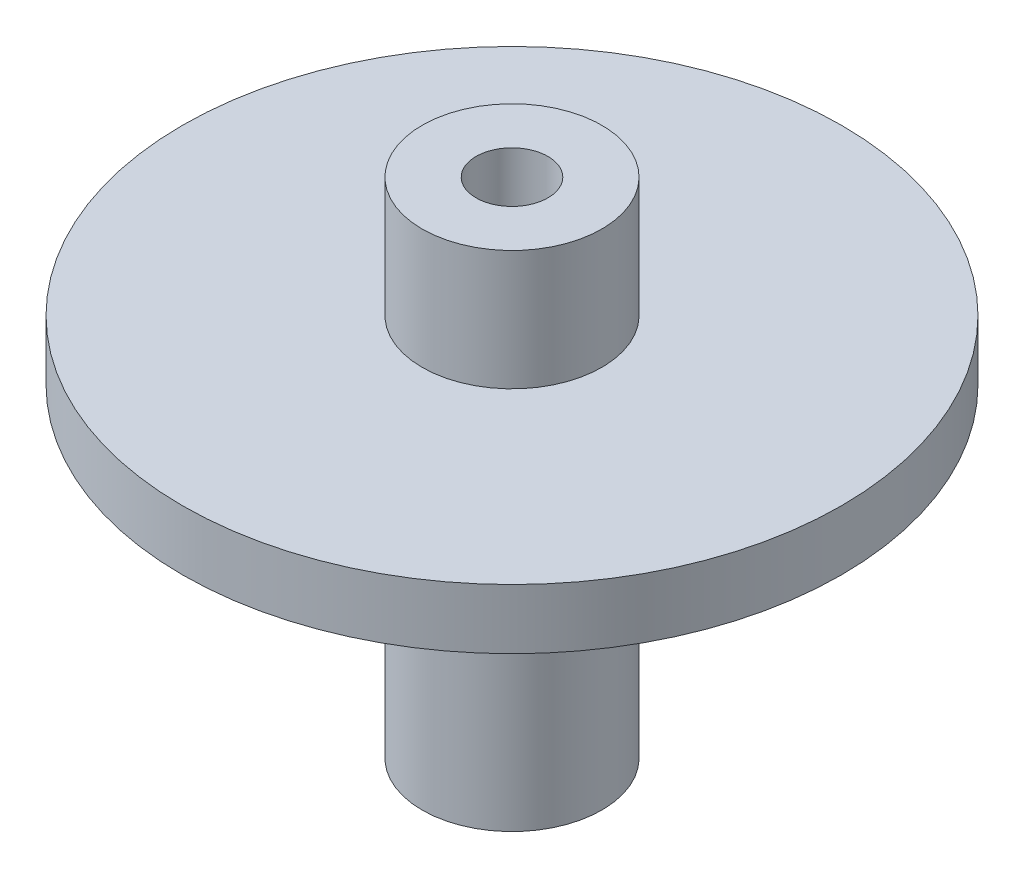
ISO-10303-21;
HEADER;
FILE_DESCRIPTION(('STEP AP214'),'2;1');
FILE_NAME('part.step','',(''),(''),'','','');
FILE_SCHEMA(('AUTOMOTIVE_DESIGN { 1 0 10303 214 1 1 1 1 }'));
ENDSEC;
DATA;
#1=APPLICATION_CONTEXT('core data for automotive mechanical design processes');
#2=APPLICATION_PROTOCOL_DEFINITION('international standard','automotive_design',2000,#1);
#3=PRODUCT_CONTEXT('',#1,'mechanical');
#4=PRODUCT('Part','Part','',(#3));
#5=PRODUCT_RELATED_PRODUCT_CATEGORY('part','',(#4));
#6=PRODUCT_DEFINITION_FORMATION('','',#4);
#7=PRODUCT_DEFINITION_CONTEXT('part definition',#1,'design');
#8=PRODUCT_DEFINITION('design','',#6,#7);
#9=PRODUCT_DEFINITION_SHAPE('','',#8);
#10=(LENGTH_UNIT() NAMED_UNIT(*) SI_UNIT(.MILLI.,.METRE.));
#11=(NAMED_UNIT(*) PLANE_ANGLE_UNIT() SI_UNIT($,.RADIAN.));
#12=(NAMED_UNIT(*) SI_UNIT($,.STERADIAN.) SOLID_ANGLE_UNIT());
#13=UNCERTAINTY_MEASURE_WITH_UNIT(LENGTH_MEASURE(1.E-05),#10,'distance_accuracy_value','');
#14=(GEOMETRIC_REPRESENTATION_CONTEXT(3) GLOBAL_UNCERTAINTY_ASSIGNED_CONTEXT((#13)) GLOBAL_UNIT_ASSIGNED_CONTEXT((#10,
#11,#12)) REPRESENTATION_CONTEXT('',''));
#15=CARTESIAN_POINT('',(0.,0.,0.));
#16=DIRECTION('',(0.,0.,1.));
#17=DIRECTION('',(1.,0.,0.));
#18=AXIS2_PLACEMENT_3D('',#15,#16,#17);
#19=CARTESIAN_POINT('',(0.,0.,3.));
#20=DIRECTION('',(0.,1.,0.));
#21=DIRECTION('',(0.,0.,1.));
#22=AXIS2_PLACEMENT_3D('',#19,#20,#21);
#23=PLANE('',#22);
#24=CARTESIAN_POINT('',(0.,0.,0.));
#25=DIRECTION('',(0.,1.,0.));
#26=DIRECTION('',(0.,0.,1.));
#27=AXIS2_PLACEMENT_3D('',#24,#25,#26);
#28=CIRCLE('',#27,27.5);
#29=CARTESIAN_POINT('',(0.,0.,27.5));
#30=VERTEX_POINT('',#29);
#31=EDGE_CURVE('E52',#30,#30,#28,.T.);
#32=ORIENTED_EDGE('',*,*,#31,.T.);
#33=EDGE_LOOP('',(#32));
#34=FACE_BOUND('',#33,.T.);
#35=CARTESIAN_POINT('',(0.,0.,0.));
#36=DIRECTION('',(0.,1.,0.));
#37=DIRECTION('',(0.,0.,1.));
#38=AXIS2_PLACEMENT_3D('',#35,#36,#37);
#39=CIRCLE('',#38,7.5);
#40=CARTESIAN_POINT('',(0.,0.,7.5));
#41=VERTEX_POINT('',#40);
#42=EDGE_CURVE('E56',#41,#41,#39,.T.);
#43=ORIENTED_EDGE('',*,*,#42,.F.);
#44=EDGE_LOOP('',(#43));
#45=FACE_BOUND('',#44,.T.);
#46=ADVANCED_FACE('F32',(#34,#45),#23,.T.);
#47=CARTESIAN_POINT('',(0.,21.6854158296505,0.));
#48=DIRECTION('',(0.,1.,0.));
#49=DIRECTION('',(0.,0.,1.));
#50=AXIS2_PLACEMENT_3D('',#47,#48,#49);
#51=CYLINDRICAL_SURFACE('',#50,27.5);
#52=CARTESIAN_POINT('',(0.,-5.,0.));
#53=DIRECTION('',(0.,1.,0.));
#54=DIRECTION('',(0.,0.,1.));
#55=AXIS2_PLACEMENT_3D('',#52,#53,#54);
#56=CIRCLE('',#55,27.5);
#57=CARTESIAN_POINT('',(0.,-5.,27.5));
#58=VERTEX_POINT('',#57);
#59=EDGE_CURVE('E10',#58,#58,#56,.T.);
#60=ORIENTED_EDGE('',*,*,#59,.T.);
#61=EDGE_LOOP('',(#60));
#62=FACE_BOUND('',#61,.T.);
#63=ORIENTED_EDGE('',*,*,#31,.F.);
#64=EDGE_LOOP('',(#63));
#65=FACE_BOUND('',#64,.T.);
#66=ADVANCED_FACE('F34',(#62,#65),#51,.T.);
#67=CARTESIAN_POINT('',(0.,-5.,27.5));
#68=DIRECTION('',(0.,-1.,0.));
#69=DIRECTION('',(0.,0.,-1.));
#70=AXIS2_PLACEMENT_3D('',#67,#68,#69);
#71=PLANE('',#70);
#72=CARTESIAN_POINT('',(0.,-5.,0.));
#73=DIRECTION('',(0.,1.,0.));
#74=DIRECTION('',(0.,0.,1.));
#75=AXIS2_PLACEMENT_3D('',#72,#73,#74);
#76=CIRCLE('',#75,7.5);
#77=CARTESIAN_POINT('',(0.,-5.,7.5));
#78=VERTEX_POINT('',#77);
#79=EDGE_CURVE('E39',#78,#78,#76,.T.);
#80=ORIENTED_EDGE('',*,*,#79,.T.);
#81=EDGE_LOOP('',(#80));
#82=FACE_BOUND('',#81,.T.);
#83=ORIENTED_EDGE('',*,*,#59,.F.);
#84=EDGE_LOOP('',(#83));
#85=FACE_BOUND('',#84,.T.);
#86=ADVANCED_FACE('F87',(#82,#85),#71,.T.);
#87=CARTESIAN_POINT('',(0.,21.6854158296505,0.));
#88=DIRECTION('',(0.,1.,0.));
#89=DIRECTION('',(0.,0.,1.));
#90=AXIS2_PLACEMENT_3D('',#87,#88,#89);
#91=CYLINDRICAL_SURFACE('',#90,7.5);
#92=CARTESIAN_POINT('',(0.,-32.,0.));
#93=DIRECTION('',(0.,1.,0.));
#94=DIRECTION('',(0.,0.,1.));
#95=AXIS2_PLACEMENT_3D('',#92,#93,#94);
#96=CIRCLE('',#95,7.49999999999999);
#97=CARTESIAN_POINT('',(0.,-32.,7.49999999999999));
#98=VERTEX_POINT('',#97);
#99=EDGE_CURVE('E43',#98,#98,#96,.T.);
#100=ORIENTED_EDGE('',*,*,#99,.T.);
#101=EDGE_LOOP('',(#100));
#102=FACE_BOUND('',#101,.T.);
#103=ORIENTED_EDGE('',*,*,#79,.F.);
#104=EDGE_LOOP('',(#103));
#105=FACE_BOUND('',#104,.T.);
#106=ADVANCED_FACE('F92',(#102,#105),#91,.T.);
#107=CARTESIAN_POINT('',(0.,-32.,7.49999999999999));
#108=DIRECTION('',(0.,-1.,0.));
#109=DIRECTION('',(0.,0.,-1.));
#110=AXIS2_PLACEMENT_3D('',#107,#108,#109);
#111=PLANE('',#110);
#112=CARTESIAN_POINT('',(0.,-32.,0.));
#113=DIRECTION('',(0.,1.,0.));
#114=DIRECTION('',(0.,0.,1.));
#115=AXIS2_PLACEMENT_3D('',#112,#113,#114);
#116=CIRCLE('',#115,2.99999999999999);
#117=CARTESIAN_POINT('',(0.,-32.,2.99999999999999));
#118=VERTEX_POINT('',#117);
#119=EDGE_CURVE('E47',#118,#118,#116,.T.);
#120=ORIENTED_EDGE('',*,*,#119,.T.);
#121=EDGE_LOOP('',(#120));
#122=FACE_BOUND('',#121,.T.);
#123=ORIENTED_EDGE('',*,*,#99,.F.);
#124=EDGE_LOOP('',(#123));
#125=FACE_BOUND('',#124,.T.);
#126=ADVANCED_FACE('F78',(#122,#125),#111,.T.);
#127=CARTESIAN_POINT('',(0.,21.6854158296505,0.));
#128=DIRECTION('',(0.,1.,0.));
#129=DIRECTION('',(0.,0.,1.));
#130=AXIS2_PLACEMENT_3D('',#127,#128,#129);
#131=CYLINDRICAL_SURFACE('',#130,3.);
#132=ORIENTED_EDGE('',*,*,#119,.F.);
#133=EDGE_LOOP('',(#132));
#134=FACE_BOUND('',#133,.T.);
#135=CARTESIAN_POINT('',(0.,10.,0.));
#136=DIRECTION('',(0.,1.,0.));
#137=DIRECTION('',(0.,0.,1.));
#138=AXIS2_PLACEMENT_3D('',#135,#136,#137);
#139=CIRCLE('',#138,3.);
#140=CARTESIAN_POINT('',(0.,10.,3.));
#141=VERTEX_POINT('',#140);
#142=EDGE_CURVE('E59',#141,#141,#139,.T.);
#143=ORIENTED_EDGE('',*,*,#142,.T.);
#144=EDGE_LOOP('',(#143));
#145=FACE_BOUND('',#144,.T.);
#146=ADVANCED_FACE('F65',(#134,#145),#131,.F.);
#147=CARTESIAN_POINT('',(0.,10.,0.));
#148=DIRECTION('',(0.,1.,0.));
#149=DIRECTION('',(0.,0.,1.));
#150=AXIS2_PLACEMENT_3D('',#147,#148,#149);
#151=PLANE('',#150);
#152=CARTESIAN_POINT('',(0.,10.,0.));
#153=DIRECTION('',(0.,1.,0.));
#154=DIRECTION('',(0.,0.,1.));
#155=AXIS2_PLACEMENT_3D('',#152,#153,#154);
#156=CIRCLE('',#155,7.5);
#157=CARTESIAN_POINT('',(0.,10.,7.5));
#158=VERTEX_POINT('',#157);
#159=EDGE_CURVE('E55',#158,#158,#156,.T.);
#160=ORIENTED_EDGE('',*,*,#159,.T.);
#161=EDGE_LOOP('',(#160));
#162=FACE_BOUND('',#161,.T.);
#163=ORIENTED_EDGE('',*,*,#142,.F.);
#164=EDGE_LOOP('',(#163));
#165=FACE_BOUND('',#164,.T.);
#166=ADVANCED_FACE('F67',(#162,#165),#151,.T.);
#167=CARTESIAN_POINT('',(0.,10.,0.));
#168=DIRECTION('',(0.,-1.,0.));
#169=DIRECTION('',(0.,0.,-1.));
#170=AXIS2_PLACEMENT_3D('',#167,#168,#169);
#171=CYLINDRICAL_SURFACE('',#170,7.5);
#172=ORIENTED_EDGE('',*,*,#159,.F.);
#173=EDGE_LOOP('',(#172));
#174=FACE_BOUND('',#173,.T.);
#175=ORIENTED_EDGE('',*,*,#42,.T.);
#176=EDGE_LOOP('',(#175));
#177=FACE_BOUND('',#176,.T.);
#178=ADVANCED_FACE('F69',(#174,#177),#171,.T.);
#179=CLOSED_SHELL('',(#46,#66,#86,#106,#126,#146,#166,#178));
#180=MANIFOLD_SOLID_BREP('B2',#179);
#181=ADVANCED_BREP_SHAPE_REPRESENTATION('',(#18,#180),#14);
#182=SHAPE_DEFINITION_REPRESENTATION(#9,#181);
ENDSEC;
END-ISO-10303-21;
